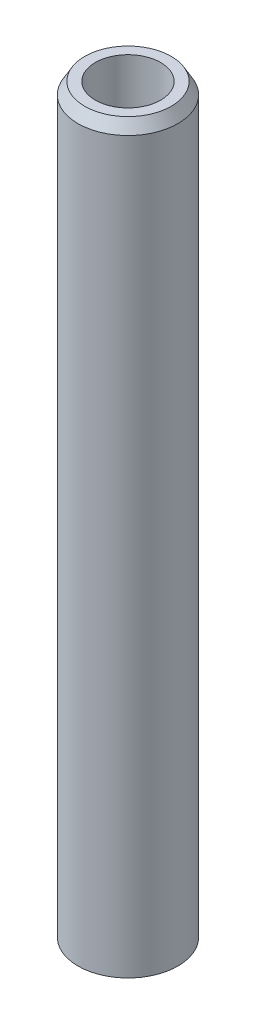
ISO-10303-21;
HEADER;
FILE_DESCRIPTION(('STEP AP214'),'2;1');
FILE_NAME('part.step','',(''),(''),'','','');
FILE_SCHEMA(('AUTOMOTIVE_DESIGN { 1 0 10303 214 1 1 1 1 }'));
ENDSEC;
DATA;
#1=APPLICATION_CONTEXT('core data for automotive mechanical design processes');
#2=APPLICATION_PROTOCOL_DEFINITION('international standard','automotive_design',2000,#1);
#3=PRODUCT_CONTEXT('',#1,'mechanical');
#4=PRODUCT('Part','Part','',(#3));
#5=PRODUCT_RELATED_PRODUCT_CATEGORY('part','',(#4));
#6=PRODUCT_DEFINITION_FORMATION('','',#4);
#7=PRODUCT_DEFINITION_CONTEXT('part definition',#1,'design');
#8=PRODUCT_DEFINITION('design','',#6,#7);
#9=PRODUCT_DEFINITION_SHAPE('','',#8);
#10=(LENGTH_UNIT() NAMED_UNIT(*) SI_UNIT(.MILLI.,.METRE.));
#11=(NAMED_UNIT(*) PLANE_ANGLE_UNIT() SI_UNIT($,.RADIAN.));
#12=(NAMED_UNIT(*) SI_UNIT($,.STERADIAN.) SOLID_ANGLE_UNIT());
#13=UNCERTAINTY_MEASURE_WITH_UNIT(LENGTH_MEASURE(1.E-05),#10,'distance_accuracy_value','');
#14=(GEOMETRIC_REPRESENTATION_CONTEXT(3) GLOBAL_UNCERTAINTY_ASSIGNED_CONTEXT((#13)) GLOBAL_UNIT_ASSIGNED_CONTEXT((#10,
#11,#12)) REPRESENTATION_CONTEXT('',''));
#15=CARTESIAN_POINT('',(0.,0.,0.));
#16=DIRECTION('',(0.,0.,1.));
#17=DIRECTION('',(1.,0.,0.));
#18=AXIS2_PLACEMENT_3D('',#15,#16,#17);
#19=CARTESIAN_POINT('',(0.,187.048750883016,0.));
#20=DIRECTION('',(0.,-1.,0.));
#21=DIRECTION('',(0.,0.,-1.));
#22=AXIS2_PLACEMENT_3D('',#19,#20,#21);
#23=CYLINDRICAL_SURFACE('',#22,12.5);
#24=CARTESIAN_POINT('',(0.,184.136744137139,0.));
#25=DIRECTION('',(0.,1.,0.));
#26=DIRECTION('',(0.,0.,1.));
#27=AXIS2_PLACEMENT_3D('',#24,#25,#26);
#28=CIRCLE('',#27,12.5);
#29=CARTESIAN_POINT('',(0.,184.136744137139,12.5));
#30=VERTEX_POINT('',#29);
#31=EDGE_CURVE('E50',#30,#30,#28,.F.);
#32=ORIENTED_EDGE('',*,*,#31,.T.);
#33=EDGE_LOOP('',(#32));
#34=FACE_BOUND('',#33,.T.);
#35=CARTESIAN_POINT('',(0.,1.68124787861351,0.));
#36=DIRECTION('',(0.,1.,0.));
#37=DIRECTION('',(0.,0.,1.));
#38=AXIS2_PLACEMENT_3D('',#35,#36,#37);
#39=CIRCLE('',#38,12.5);
#40=CARTESIAN_POINT('',(0.,1.68124787861351,12.5));
#41=VERTEX_POINT('',#40);
#42=EDGE_CURVE('E51',#41,#41,#39,.T.);
#43=ORIENTED_EDGE('',*,*,#42,.T.);
#44=EDGE_LOOP('',(#43));
#45=FACE_BOUND('',#44,.T.);
#46=ADVANCED_FACE('F39',(#34,#45),#23,.T.);
#47=CARTESIAN_POINT('',(0.,187.048750883016,0.));
#48=DIRECTION('',(0.,1.,0.));
#49=DIRECTION('',(0.,0.,1.));
#50=AXIS2_PLACEMENT_3D('',#47,#48,#49);
#51=PLANE('',#50);
#52=CARTESIAN_POINT('',(0.,187.048750883016,0.));
#53=DIRECTION('',(0.,1.,0.));
#54=DIRECTION('',(0.,0.,1.));
#55=AXIS2_PLACEMENT_3D('',#52,#53,#54);
#56=CIRCLE('',#55,10.8187521213865);
#57=CARTESIAN_POINT('',(0.,187.048750883016,10.8187521213865));
#58=VERTEX_POINT('',#57);
#59=EDGE_CURVE('E54',#58,#58,#56,.T.);
#60=ORIENTED_EDGE('',*,*,#59,.T.);
#61=EDGE_LOOP('',(#60));
#62=FACE_BOUND('',#61,.T.);
#63=CARTESIAN_POINT('',(0.,187.048750883016,0.));
#64=DIRECTION('',(0.,1.,0.));
#65=DIRECTION('',(0.,0.,1.));
#66=AXIS2_PLACEMENT_3D('',#63,#64,#65);
#67=CIRCLE('',#66,8.16866172134928);
#68=CARTESIAN_POINT('',(0.,187.048750883016,8.16866172134928));
#69=VERTEX_POINT('',#68);
#70=EDGE_CURVE('E58',#69,#69,#67,.T.);
#71=ORIENTED_EDGE('',*,*,#70,.F.);
#72=EDGE_LOOP('',(#71));
#73=FACE_BOUND('',#72,.T.);
#74=ADVANCED_FACE('F69',(#62,#73),#51,.T.);
#75=CARTESIAN_POINT('',(0.,0.,0.));
#76=DIRECTION('',(0.,1.,0.));
#77=DIRECTION('',(0.,0.,1.));
#78=AXIS2_PLACEMENT_3D('',#75,#76,#77);
#79=PLANE('',#78);
#80=CARTESIAN_POINT('',(0.,0.,0.));
#81=DIRECTION('',(0.,1.,0.));
#82=DIRECTION('',(0.,0.,1.));
#83=AXIS2_PLACEMENT_3D('',#80,#81,#82);
#84=CIRCLE('',#83,9.58799325412402);
#85=CARTESIAN_POINT('',(0.,0.,9.58799325412402));
#86=VERTEX_POINT('',#85);
#87=EDGE_CURVE('E10',#86,#86,#84,.F.);
#88=ORIENTED_EDGE('',*,*,#87,.T.);
#89=EDGE_LOOP('',(#88));
#90=FACE_BOUND('',#89,.T.);
#91=CARTESIAN_POINT('',(0.,0.,0.));
#92=DIRECTION('',(0.,1.,0.));
#93=DIRECTION('',(0.,0.,1.));
#94=AXIS2_PLACEMENT_3D('',#91,#92,#93);
#95=CIRCLE('',#94,8.16866172134928);
#96=CARTESIAN_POINT('',(0.,0.,8.16866172134928));
#97=VERTEX_POINT('',#96);
#98=EDGE_CURVE('E63',#97,#97,#95,.T.);
#99=ORIENTED_EDGE('',*,*,#98,.T.);
#100=EDGE_LOOP('',(#99));
#101=FACE_BOUND('',#100,.T.);
#102=ADVANCED_FACE('F75',(#90,#101),#79,.F.);
#103=CARTESIAN_POINT('',(0.,187.048750883016,0.));
#104=DIRECTION('',(0.,-1.,0.));
#105=DIRECTION('',(0.,0.,-1.));
#106=AXIS2_PLACEMENT_3D('',#103,#104,#105);
#107=CYLINDRICAL_SURFACE('',#106,8.16866172134928);
#108=ORIENTED_EDGE('',*,*,#70,.T.);
#109=EDGE_LOOP('',(#108));
#110=FACE_BOUND('',#109,.T.);
#111=ORIENTED_EDGE('',*,*,#98,.F.);
#112=EDGE_LOOP('',(#111));
#113=FACE_BOUND('',#112,.T.);
#114=ADVANCED_FACE('F70',(#110,#113),#107,.F.);
#115=CARTESIAN_POINT('',(0.,187.048750883016,0.));
#116=DIRECTION('',(0.,-1.,0.));
#117=DIRECTION('',(0.,0.,-1.));
#118=AXIS2_PLACEMENT_3D('',#115,#116,#117);
#119=CONICAL_SURFACE('',#118,10.8187521213865,0.523598775598295);
#120=ORIENTED_EDGE('',*,*,#31,.F.);
#121=EDGE_LOOP('',(#120));
#122=FACE_BOUND('',#121,.T.);
#123=ORIENTED_EDGE('',*,*,#59,.F.);
#124=EDGE_LOOP('',(#123));
#125=FACE_BOUND('',#124,.T.);
#126=ADVANCED_FACE('F81',(#122,#125),#119,.T.);
#127=CARTESIAN_POINT('',(0.,1.68124787861351,0.));
#128=DIRECTION('',(0.,1.,0.));
#129=DIRECTION('',(0.,0.,1.));
#130=AXIS2_PLACEMENT_3D('',#127,#128,#129);
#131=CONICAL_SURFACE('',#130,12.5,1.0471975511966);
#132=ORIENTED_EDGE('',*,*,#87,.F.);
#133=EDGE_LOOP('',(#132));
#134=FACE_BOUND('',#133,.T.);
#135=ORIENTED_EDGE('',*,*,#42,.F.);
#136=EDGE_LOOP('',(#135));
#137=FACE_BOUND('',#136,.T.);
#138=ADVANCED_FACE('F45',(#134,#137),#131,.T.);
#139=CLOSED_SHELL('',(#46,#74,#102,#114,#126,#138));
#140=MANIFOLD_SOLID_BREP('B2',#139);
#141=ADVANCED_BREP_SHAPE_REPRESENTATION('',(#18,#140),#14);
#142=SHAPE_DEFINITION_REPRESENTATION(#9,#141);
ENDSEC;
END-ISO-10303-21;
